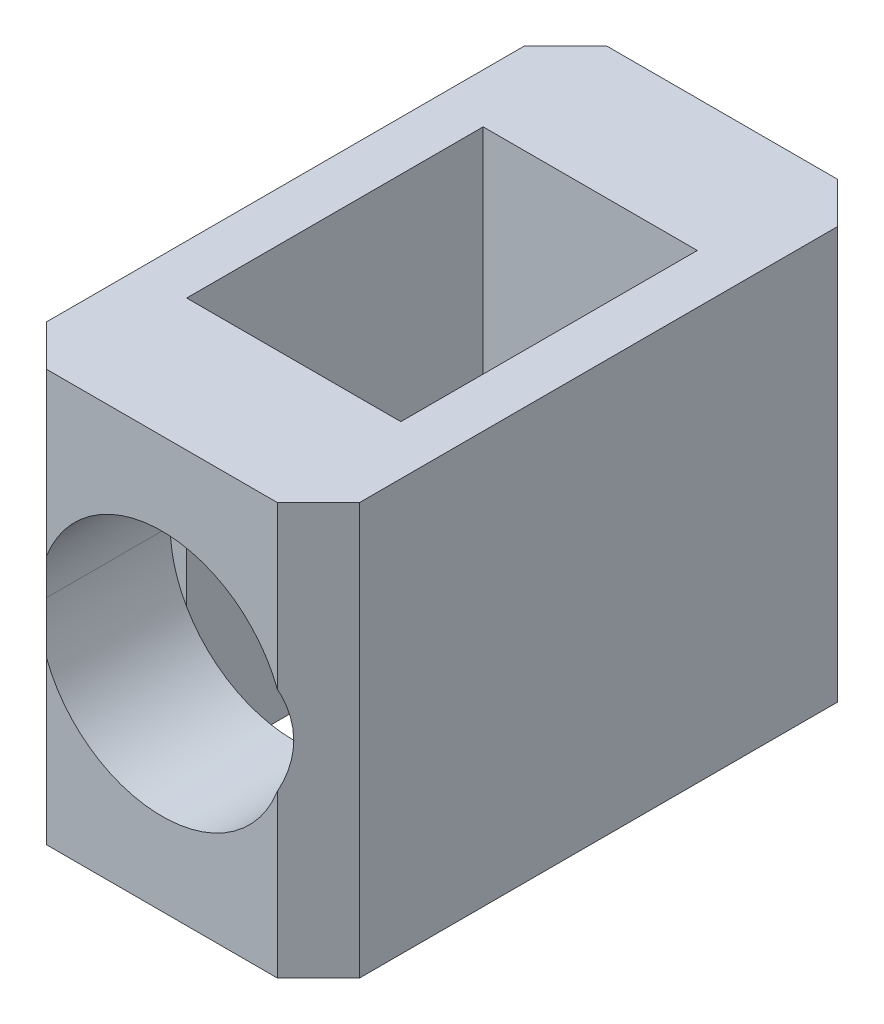
ISO-10303-21;
HEADER;
FILE_DESCRIPTION(('STEP AP214'),'2;1');
FILE_NAME('part.step','',(''),(''),'','','');
FILE_SCHEMA(('AUTOMOTIVE_DESIGN { 1 0 10303 214 1 1 1 1 }'));
ENDSEC;
DATA;
#1=APPLICATION_CONTEXT('core data for automotive mechanical design processes');
#2=APPLICATION_PROTOCOL_DEFINITION('international standard','automotive_design',2000,#1);
#3=PRODUCT_CONTEXT('',#1,'mechanical');
#4=PRODUCT('Part','Part','',(#3));
#5=PRODUCT_RELATED_PRODUCT_CATEGORY('part','',(#4));
#6=PRODUCT_DEFINITION_FORMATION('','',#4);
#7=PRODUCT_DEFINITION_CONTEXT('part definition',#1,'design');
#8=PRODUCT_DEFINITION('design','',#6,#7);
#9=PRODUCT_DEFINITION_SHAPE('','',#8);
#10=(LENGTH_UNIT() NAMED_UNIT(*) SI_UNIT(.MILLI.,.METRE.));
#11=(NAMED_UNIT(*) PLANE_ANGLE_UNIT() SI_UNIT($,.RADIAN.));
#12=(NAMED_UNIT(*) SI_UNIT($,.STERADIAN.) SOLID_ANGLE_UNIT());
#13=UNCERTAINTY_MEASURE_WITH_UNIT(LENGTH_MEASURE(1.E-05),#10,'distance_accuracy_value','');
#14=(GEOMETRIC_REPRESENTATION_CONTEXT(3) GLOBAL_UNCERTAINTY_ASSIGNED_CONTEXT((#13)) GLOBAL_UNIT_ASSIGNED_CONTEXT((#10,
#11,#12)) REPRESENTATION_CONTEXT('',''));
#15=CARTESIAN_POINT('',(0.,0.,0.));
#16=DIRECTION('',(0.,0.,1.));
#17=DIRECTION('',(1.,0.,0.));
#18=AXIS2_PLACEMENT_3D('',#15,#16,#17);
#19=CARTESIAN_POINT('',(12.6999999999998,5.27000000000021,8.43));
#20=DIRECTION('',(0.,0.,-1.));
#21=DIRECTION('',(-1.,0.,0.));
#22=AXIS2_PLACEMENT_3D('',#19,#20,#21);
#23=CYLINDRICAL_SURFACE('',#22,1.5);
#24=DIRECTION('',(0.,0.,1.));
#25=VECTOR('',#24,1.);
#26=CARTESIAN_POINT('',(11.2000000000003,5.26999999999963,8.43));
#27=LINE('',#26,#25);
#28=CARTESIAN_POINT('',(11.2000000000003,5.26999999999963,6.83));
#29=VERTEX_POINT('',#28);
#30=CARTESIAN_POINT('',(11.2000000000003,5.26999999999963,8.33));
#31=VERTEX_POINT('',#30);
#32=EDGE_CURVE('E235',#29,#31,#27,.T.);
#33=ORIENTED_EDGE('',*,*,#32,.F.);
#34=CARTESIAN_POINT('',(12.6999999999997,5.27000000000021,6.82999999999992));
#35=DIRECTION('',(0.,0.,1.));
#36=DIRECTION('',(-1.,0.,0.));
#37=AXIS2_PLACEMENT_3D('',#34,#35,#36);
#38=CIRCLE('',#37,1.5);
#39=CARTESIAN_POINT('',(11.4,6.01833147735468,6.83));
#40=VERTEX_POINT('',#39);
#41=EDGE_CURVE('E28',#40,#29,#38,.T.);
#42=ORIENTED_EDGE('',*,*,#41,.F.);
#43=CARTESIAN_POINT('',(12.6999999999997,5.27000000000021,6.83));
#44=DIRECTION('',(0.,0.,1.));
#45=DIRECTION('',(-1.,0.,0.));
#46=AXIS2_PLACEMENT_3D('',#43,#44,#45);
#47=CIRCLE('',#46,1.5);
#48=CARTESIAN_POINT('',(14.,6.01833147735475,6.82999999999989));
#49=VERTEX_POINT('',#48);
#50=EDGE_CURVE('E274',#49,#40,#47,.T.);
#51=ORIENTED_EDGE('',*,*,#50,.F.);
#52=CARTESIAN_POINT('',(12.6999999999997,5.27000000000021,6.82999999999992));
#53=DIRECTION('',(0.,0.,1.));
#54=DIRECTION('',(-1.,0.,0.));
#55=AXIS2_PLACEMENT_3D('',#52,#53,#54);
#56=CIRCLE('',#55,1.5);
#57=CARTESIAN_POINT('',(14.1999999999998,5.27000000000007,6.82999999999989));
#58=VERTEX_POINT('',#57);
#59=EDGE_CURVE('E11',#58,#49,#56,.T.);
#60=ORIENTED_EDGE('',*,*,#59,.F.);
#61=DIRECTION('',(0.,0.,1.));
#62=VECTOR('',#61,1.);
#63=CARTESIAN_POINT('',(14.2,5.27000000000007,8.43));
#64=LINE('',#63,#62);
#65=CARTESIAN_POINT('',(14.1999999999998,5.27000000000007,8.32999999999989));
#66=VERTEX_POINT('',#65);
#67=EDGE_CURVE('E232',#58,#66,#64,.T.);
#68=ORIENTED_EDGE('',*,*,#67,.T.);
#69=CARTESIAN_POINT('',(12.6999999999998,5.27000000000021,9.83));
#70=DIRECTION('',(0.707106781186561,0.,0.707106781186534));
#71=DIRECTION('',(-0.707106781186534,0.,0.707106781186561));
#72=AXIS2_PLACEMENT_3D('',#69,#70,#71);
#73=ELLIPSE('',#72,2.12132034355964,1.5);
#74=CARTESIAN_POINT('',(14.0999999999998,5.80851648071365,8.43));
#75=VERTEX_POINT('',#74);
#76=EDGE_CURVE('E246',#66,#75,#73,.T.);
#77=ORIENTED_EDGE('',*,*,#76,.T.);
#78=CARTESIAN_POINT('',(12.6999999999998,5.27000000000021,8.43));
#79=DIRECTION('',(0.,0.,1.));
#80=DIRECTION('',(-1.,0.,0.));
#81=AXIS2_PLACEMENT_3D('',#78,#79,#80);
#82=CIRCLE('',#81,1.5);
#83=CARTESIAN_POINT('',(11.3,5.80851648071329,8.43));
#84=VERTEX_POINT('',#83);
#85=EDGE_CURVE('E269',#75,#84,#82,.T.);
#86=ORIENTED_EDGE('',*,*,#85,.T.);
#87=CARTESIAN_POINT('',(12.6999999999998,5.27000000000021,9.83));
#88=DIRECTION('',(-0.707106781186535,0.,0.70710678118656));
#89=DIRECTION('',(0.70710678118656,0.,0.707106781186535));
#90=AXIS2_PLACEMENT_3D('',#87,#88,#89);
#91=ELLIPSE('',#90,2.12132034355964,1.5);
#92=EDGE_CURVE('E247',#84,#31,#91,.T.);
#93=ORIENTED_EDGE('',*,*,#92,.T.);
#94=EDGE_LOOP('',(#33,#42,#51,#60,#68,#77,#86,#93));
#95=FACE_BOUND('',#94,.T.);
#96=ADVANCED_FACE('F17',(#95),#23,.F.);
#97=CARTESIAN_POINT('',(14.0250000000003,5.26999999999963,6.82999999999989));
#98=DIRECTION('',(0.,0.,1.));
#99=DIRECTION('',(1.,0.,0.));
#100=AXIS2_PLACEMENT_3D('',#97,#98,#99);
#101=PLANE('',#100);
#102=DIRECTION('',(0.,-1.,0.));
#103=VECTOR('',#102,1.);
#104=CARTESIAN_POINT('',(13.9999999999998,2.77000000000016,6.82999999999989));
#105=LINE('',#104,#103);
#106=CARTESIAN_POINT('',(14.,4.52166852264494,6.82999999999989));
#107=VERTEX_POINT('',#106);
#108=EDGE_CURVE('E219',#49,#107,#105,.T.);
#109=ORIENTED_EDGE('',*,*,#108,.T.);
#110=CARTESIAN_POINT('',(12.6999999999997,5.27000000000021,6.82999999999992));
#111=DIRECTION('',(0.,0.,1.));
#112=DIRECTION('',(-1.,0.,0.));
#113=AXIS2_PLACEMENT_3D('',#110,#111,#112);
#114=CIRCLE('',#113,1.5);
#115=EDGE_CURVE('E117',#107,#58,#114,.T.);
#116=ORIENTED_EDGE('',*,*,#115,.T.);
#117=ORIENTED_EDGE('',*,*,#59,.T.);
#118=EDGE_LOOP('',(#109,#116,#117));
#119=FACE_BOUND('',#118,.T.);
#120=ADVANCED_FACE('F639',(#119),#101,.T.);
#121=CARTESIAN_POINT('',(14.0250000000003,5.26999999999963,6.82999999999989));
#122=DIRECTION('',(0.,0.,1.));
#123=DIRECTION('',(1.,0.,0.));
#124=AXIS2_PLACEMENT_3D('',#121,#122,#123);
#125=PLANE('',#124);
#126=CARTESIAN_POINT('',(12.6999999999997,5.27000000000021,6.82999999999992));
#127=DIRECTION('',(0.,0.,1.));
#128=DIRECTION('',(-1.,0.,0.));
#129=AXIS2_PLACEMENT_3D('',#126,#127,#128);
#130=CIRCLE('',#129,1.5);
#131=CARTESIAN_POINT('',(11.4000000000002,4.52166852264501,6.83));
#132=VERTEX_POINT('',#131);
#133=EDGE_CURVE('E254',#29,#132,#130,.T.);
#134=ORIENTED_EDGE('',*,*,#133,.T.);
#135=DIRECTION('',(0.,1.,0.));
#136=VECTOR('',#135,1.);
#137=CARTESIAN_POINT('',(11.4,2.77000000000016,6.83));
#138=LINE('',#137,#136);
#139=EDGE_CURVE('E334',#132,#40,#138,.T.);
#140=ORIENTED_EDGE('',*,*,#139,.T.);
#141=ORIENTED_EDGE('',*,*,#41,.T.);
#142=EDGE_LOOP('',(#134,#140,#141));
#143=FACE_BOUND('',#142,.T.);
#144=ADVANCED_FACE('F645',(#143),#125,.T.);
#145=CARTESIAN_POINT('',(12.6999999999998,5.27000000000021,8.43));
#146=DIRECTION('',(0.,0.,-1.));
#147=DIRECTION('',(-1.,0.,0.));
#148=AXIS2_PLACEMENT_3D('',#145,#146,#147);
#149=CYLINDRICAL_SURFACE('',#148,1.5);
#150=ORIENTED_EDGE('',*,*,#133,.F.);
#151=ORIENTED_EDGE('',*,*,#32,.T.);
#152=CARTESIAN_POINT('',(12.6999999999998,5.27000000000021,9.83));
#153=DIRECTION('',(-0.707106781186535,0.,0.70710678118656));
#154=DIRECTION('',(0.70710678118656,0.,0.707106781186535));
#155=AXIS2_PLACEMENT_3D('',#152,#153,#154);
#156=ELLIPSE('',#155,2.12132034355964,1.5);
#157=CARTESIAN_POINT('',(11.2999999999998,4.73148351928682,8.43));
#158=VERTEX_POINT('',#157);
#159=EDGE_CURVE('E245',#31,#158,#156,.T.);
#160=ORIENTED_EDGE('',*,*,#159,.T.);
#161=CARTESIAN_POINT('',(12.6999999999998,5.27000000000021,8.43));
#162=DIRECTION('',(0.,0.,1.));
#163=DIRECTION('',(-1.,0.,0.));
#164=AXIS2_PLACEMENT_3D('',#161,#162,#163);
#165=CIRCLE('',#164,1.5);
#166=CARTESIAN_POINT('',(14.1000000000002,4.73148351928624,8.43));
#167=VERTEX_POINT('',#166);
#168=EDGE_CURVE('E293',#158,#167,#165,.T.);
#169=ORIENTED_EDGE('',*,*,#168,.T.);
#170=CARTESIAN_POINT('',(12.6999999999998,5.27000000000021,9.83));
#171=DIRECTION('',(0.707106781186561,0.,0.707106781186534));
#172=DIRECTION('',(-0.707106781186534,0.,0.707106781186561));
#173=AXIS2_PLACEMENT_3D('',#170,#171,#172);
#174=ELLIPSE('',#173,2.12132034355964,1.5);
#175=EDGE_CURVE('E241',#167,#66,#174,.T.);
#176=ORIENTED_EDGE('',*,*,#175,.T.);
#177=ORIENTED_EDGE('',*,*,#67,.F.);
#178=ORIENTED_EDGE('',*,*,#115,.F.);
#179=CARTESIAN_POINT('',(12.6999999999997,5.27000000000021,6.83));
#180=DIRECTION('',(0.,0.,1.));
#181=DIRECTION('',(-1.,0.,0.));
#182=AXIS2_PLACEMENT_3D('',#179,#180,#181);
#183=CIRCLE('',#182,1.5);
#184=EDGE_CURVE('E251',#132,#107,#183,.T.);
#185=ORIENTED_EDGE('',*,*,#184,.F.);
#186=EDGE_LOOP('',(#150,#151,#160,#169,#176,#177,#178,#185));
#187=FACE_BOUND('',#186,.T.);
#188=ADVANCED_FACE('F439',(#187),#149,.F.);
#189=CARTESIAN_POINT('',(13.6999999999996,7.77000000000033,6.83));
#190=DIRECTION('',(0.,0.,1.));
#191=DIRECTION('',(1.,0.,0.));
#192=AXIS2_PLACEMENT_3D('',#189,#190,#191);
#193=PLANE('',#192);
#194=ORIENTED_EDGE('',*,*,#184,.T.);
#195=DIRECTION('',(0.,1.,0.));
#196=VECTOR('',#195,1.);
#197=CARTESIAN_POINT('',(13.9999999999998,2.77000000000016,6.83));
#198=LINE('',#197,#196);
#199=CARTESIAN_POINT('',(13.9999999999998,2.77000000000016,6.83));
#200=VERTEX_POINT('',#199);
#201=EDGE_CURVE('E227',#200,#107,#198,.T.);
#202=ORIENTED_EDGE('',*,*,#201,.F.);
#203=DIRECTION('',(1.,0.,0.));
#204=VECTOR('',#203,1.);
#205=CARTESIAN_POINT('',(70.6110968965142,2.7700000000002,6.82999999999898));
#206=LINE('',#205,#204);
#207=CARTESIAN_POINT('',(11.4,2.77000000000016,6.83));
#208=VERTEX_POINT('',#207);
#209=EDGE_CURVE('E132',#208,#200,#206,.T.);
#210=ORIENTED_EDGE('',*,*,#209,.F.);
#211=DIRECTION('',(0.,1.,0.));
#212=VECTOR('',#211,1.);
#213=CARTESIAN_POINT('',(11.4,2.77000000000016,6.83));
#214=LINE('',#213,#212);
#215=EDGE_CURVE('E338',#208,#132,#214,.T.);
#216=ORIENTED_EDGE('',*,*,#215,.T.);
#217=EDGE_LOOP('',(#194,#202,#210,#216));
#218=FACE_BOUND('',#217,.T.);
#219=ADVANCED_FACE('F711',(#218),#193,.F.);
#220=CARTESIAN_POINT('',(11.0500000000003,5.26999999999964,8.18));
#221=DIRECTION('',(-0.707106781186534,0.,0.707106781186561));
#222=DIRECTION('',(0.,1.,0.));
#223=AXIS2_PLACEMENT_3D('',#220,#221,#222);
#224=PLANE('',#223);
#225=DIRECTION('',(0.,1.,0.));
#226=VECTOR('',#225,1.);
#227=CARTESIAN_POINT('',(10.8,5.26999999999984,7.93));
#228=LINE('',#227,#226);
#229=CARTESIAN_POINT('',(10.7999999999998,2.77000000000016,7.93));
#230=VERTEX_POINT('',#229);
#231=CARTESIAN_POINT('',(10.8000000000003,7.76999999999961,7.93));
#232=VERTEX_POINT('',#231);
#233=EDGE_CURVE('E348',#230,#232,#228,.T.);
#234=ORIENTED_EDGE('',*,*,#233,.F.);
#235=DIRECTION('',(-0.70710678118656,0.,-0.707106781186535));
#236=VECTOR('',#235,1.);
#237=CARTESIAN_POINT('',(-51.920076808694,2.76999999999905,-54.7900768086914));
#238=LINE('',#237,#236);
#239=CARTESIAN_POINT('',(11.3000000000003,2.76999999999965,8.43));
#240=VERTEX_POINT('',#239);
#241=EDGE_CURVE('E240',#240,#230,#238,.T.);
#242=ORIENTED_EDGE('',*,*,#241,.F.);
#243=DIRECTION('',(0.,1.,0.));
#244=VECTOR('',#243,1.);
#245=CARTESIAN_POINT('',(11.2999999999998,5.27000000000006,8.43));
#246=LINE('',#245,#244);
#247=EDGE_CURVE('E297',#240,#158,#246,.T.);
#248=ORIENTED_EDGE('',*,*,#247,.T.);
#249=ORIENTED_EDGE('',*,*,#159,.F.);
#250=ORIENTED_EDGE('',*,*,#92,.F.);
#251=DIRECTION('',(0.,1.,0.));
#252=VECTOR('',#251,1.);
#253=CARTESIAN_POINT('',(11.2999999999998,5.27000000000006,8.43));
#254=LINE('',#253,#252);
#255=CARTESIAN_POINT('',(11.3,7.76999999999983,8.43));
#256=VERTEX_POINT('',#255);
#257=EDGE_CURVE('E284',#84,#256,#254,.T.);
#258=ORIENTED_EDGE('',*,*,#257,.T.);
#259=DIRECTION('',(-0.70710678118656,0.,-0.707106781186535));
#260=VECTOR('',#259,1.);
#261=CARTESIAN_POINT('',(-51.9200768086941,7.76999999999941,-54.7900768086914));
#262=LINE('',#261,#260);
#263=EDGE_CURVE('E353',#256,#232,#262,.T.);
#264=ORIENTED_EDGE('',*,*,#263,.T.);
#265=EDGE_LOOP('',(#234,#242,#248,#249,#250,#258,#264));
#266=FACE_BOUND('',#265,.T.);
#267=ADVANCED_FACE('F440',(#266),#224,.T.);
#268=CARTESIAN_POINT('',(14.35,5.27,8.18));
#269=DIRECTION('',(0.70710678118656,0.,0.707106781186535));
#270=DIRECTION('',(0.,-1.,0.));
#271=AXIS2_PLACEMENT_3D('',#268,#269,#270);
#272=PLANE('',#271);
#273=DIRECTION('',(0.,-1.,0.));
#274=VECTOR('',#273,1.);
#275=CARTESIAN_POINT('',(14.6000000000002,5.26999999999985,7.93));
#276=LINE('',#275,#274);
#277=CARTESIAN_POINT('',(14.5999999999997,7.77000000000023,7.93));
#278=VERTEX_POINT('',#277);
#279=CARTESIAN_POINT('',(14.6,2.77000000000009,7.93));
#280=VERTEX_POINT('',#279);
#281=EDGE_CURVE('E379',#278,#280,#276,.T.);
#282=ORIENTED_EDGE('',*,*,#281,.F.);
#283=DIRECTION('',(-0.707106781186534,0.,0.707106781186561));
#284=VECTOR('',#283,1.);
#285=CARTESIAN_POINT('',(77.3200768086914,7.77000000000049,-54.7900768086937));
#286=LINE('',#285,#284);
#287=CARTESIAN_POINT('',(14.1,7.77,8.43));
#288=VERTEX_POINT('',#287);
#289=EDGE_CURVE('E231',#278,#288,#286,.T.);
#290=ORIENTED_EDGE('',*,*,#289,.T.);
#291=DIRECTION('',(0.,-1.,0.));
#292=VECTOR('',#291,1.);
#293=CARTESIAN_POINT('',(14.1000000000004,5.26999999999964,8.43));
#294=LINE('',#293,#292);
#295=EDGE_CURVE('E273',#288,#75,#294,.T.);
#296=ORIENTED_EDGE('',*,*,#295,.T.);
#297=ORIENTED_EDGE('',*,*,#76,.F.);
#298=ORIENTED_EDGE('',*,*,#175,.F.);
#299=DIRECTION('',(0.,-1.,0.));
#300=VECTOR('',#299,1.);
#301=CARTESIAN_POINT('',(14.1000000000004,5.26999999999964,8.43));
#302=LINE('',#301,#300);
#303=CARTESIAN_POINT('',(14.1,2.76999999999987,8.43));
#304=VERTEX_POINT('',#303);
#305=EDGE_CURVE('E214',#167,#304,#302,.T.);
#306=ORIENTED_EDGE('',*,*,#305,.T.);
#307=DIRECTION('',(-0.707106781186534,0.,0.707106781186561));
#308=VECTOR('',#307,1.);
#309=CARTESIAN_POINT('',(77.3200768086915,2.77000000000048,-54.7900768086937));
#310=LINE('',#309,#308);
#311=EDGE_CURVE('E281',#280,#304,#310,.T.);
#312=ORIENTED_EDGE('',*,*,#311,.F.);
#313=EDGE_LOOP('',(#282,#290,#296,#297,#298,#306,#312));
#314=FACE_BOUND('',#313,.T.);
#315=ADVANCED_FACE('F444',(#314),#272,.T.);
#316=CARTESIAN_POINT('',(11.0500000000002,5.26999999999964,1.87999999999996));
#317=DIRECTION('',(-0.70710678118656,0.,-0.707106781186535));
#318=DIRECTION('',(-0.707106781186535,0.,0.70710678118656));
#319=AXIS2_PLACEMENT_3D('',#316,#317,#318);
#320=PLANE('',#319);
#321=DIRECTION('',(0.,-1.,0.));
#322=VECTOR('',#321,1.);
#323=CARTESIAN_POINT('',(10.8,5.26999999999984,2.12999999999996));
#324=LINE('',#323,#322);
#325=CARTESIAN_POINT('',(10.8000000000002,7.76999999999961,2.13000000000006));
#326=VERTEX_POINT('',#325);
#327=CARTESIAN_POINT('',(10.7999999999997,2.77000000000016,2.13000000000006));
#328=VERTEX_POINT('',#327);
#329=EDGE_CURVE('E260',#326,#328,#324,.T.);
#330=ORIENTED_EDGE('',*,*,#329,.F.);
#331=DIRECTION('',(0.707106781186534,0.,-0.707106781186561));
#332=VECTOR('',#331,1.);
#333=CARTESIAN_POINT('',(67.7200768086915,7.77000000000034,-54.7900768086936));
#334=LINE('',#333,#332);
#335=CARTESIAN_POINT('',(11.3,7.76999999999983,1.63000000000004));
#336=VERTEX_POINT('',#335);
#337=EDGE_CURVE('E357',#326,#336,#334,.T.);
#338=ORIENTED_EDGE('',*,*,#337,.T.);
#339=DIRECTION('',(0.,-1.,0.));
#340=VECTOR('',#339,1.);
#341=CARTESIAN_POINT('',(11.2999999999997,5.27000000000006,1.62999999999994));
#342=LINE('',#341,#340);
#343=CARTESIAN_POINT('',(11.3000000000002,2.76999999999965,1.63000000000004));
#344=VERTEX_POINT('',#343);
#345=EDGE_CURVE('E290',#336,#344,#342,.T.);
#346=ORIENTED_EDGE('',*,*,#345,.T.);
#347=DIRECTION('',(0.707106781186534,0.,-0.707106781186561));
#348=VECTOR('',#347,1.);
#349=CARTESIAN_POINT('',(67.7200768086917,2.77000000000019,-54.7900768086936));
#350=LINE('',#349,#348);
#351=EDGE_CURVE('E236',#328,#344,#350,.T.);
#352=ORIENTED_EDGE('',*,*,#351,.F.);
#353=EDGE_LOOP('',(#330,#338,#346,#352));
#354=FACE_BOUND('',#353,.T.);
#355=ADVANCED_FACE('F394',(#354),#320,.T.);
#356=CARTESIAN_POINT('',(14.3499999999998,5.27,1.87999999999989));
#357=DIRECTION('',(0.707106781186535,0.,-0.707106781186561));
#358=DIRECTION('',(0.,-1.,0.));
#359=AXIS2_PLACEMENT_3D('',#356,#357,#358);
#360=PLANE('',#359);
#361=DIRECTION('',(0.,-1.,0.));
#362=VECTOR('',#361,1.);
#363=CARTESIAN_POINT('',(14.1000000000002,5.26999999999964,1.6299999999999));
#364=LINE('',#363,#362);
#365=CARTESIAN_POINT('',(14.0999999999997,7.77,1.63));
#366=VERTEX_POINT('',#365);
#367=CARTESIAN_POINT('',(14.1,2.76999999999987,1.63));
#368=VERTEX_POINT('',#367);
#369=EDGE_CURVE('E201',#366,#368,#364,.T.);
#370=ORIENTED_EDGE('',*,*,#369,.F.);
#371=DIRECTION('',(0.70710678118656,0.,0.707106781186535));
#372=VECTOR('',#371,1.);
#373=CARTESIAN_POINT('',(-42.3200768086939,7.76999999999941,-54.7900768086916));
#374=LINE('',#373,#372);
#375=CARTESIAN_POINT('',(14.5999999999996,7.77000000000023,2.13));
#376=VERTEX_POINT('',#375);
#377=EDGE_CURVE('E202',#366,#376,#374,.T.);
#378=ORIENTED_EDGE('',*,*,#377,.T.);
#379=DIRECTION('',(0.,-1.,0.));
#380=VECTOR('',#379,1.);
#381=CARTESIAN_POINT('',(14.6,5.26999999999985,2.12999999999989));
#382=LINE('',#381,#380);
#383=CARTESIAN_POINT('',(14.5999999999998,2.77000000000009,2.13));
#384=VERTEX_POINT('',#383);
#385=EDGE_CURVE('E275',#376,#384,#382,.T.);
#386=ORIENTED_EDGE('',*,*,#385,.T.);
#387=DIRECTION('',(0.70710678118656,0.,0.707106781186535));
#388=VECTOR('',#387,1.);
#389=CARTESIAN_POINT('',(-42.3200768086939,2.76999999999905,-54.7900768086916));
#390=LINE('',#389,#388);
#391=EDGE_CURVE('E239',#368,#384,#390,.T.);
#392=ORIENTED_EDGE('',*,*,#391,.F.);
#393=EDGE_LOOP('',(#370,#378,#386,#392));
#394=FACE_BOUND('',#393,.T.);
#395=ADVANCED_FACE('F689',(#394),#360,.T.);
#396=CARTESIAN_POINT('',(70.611096896513,2.77000000000019,-54.7900768086936));
#397=DIRECTION('',(0.,1.,0.));
#398=DIRECTION('',(1.,0.,0.));
#399=AXIS2_PLACEMENT_3D('',#396,#397,#398);
#400=PLANE('',#399);
#401=DIRECTION('',(0.,0.,1.));
#402=VECTOR('',#401,1.);
#403=CARTESIAN_POINT('',(11.3999999999988,2.77000000000015,-54.7900768086926));
#404=LINE('',#403,#402);
#405=CARTESIAN_POINT('',(11.3999999999998,2.77000000000016,3.22999999999994));
#406=VERTEX_POINT('',#405);
#407=EDGE_CURVE('E311',#406,#208,#404,.T.);
#408=ORIENTED_EDGE('',*,*,#407,.T.);
#409=ORIENTED_EDGE('',*,*,#209,.T.);
#410=DIRECTION('',(0.,0.,-1.));
#411=VECTOR('',#410,1.);
#412=CARTESIAN_POINT('',(13.9999999999987,2.77000000000015,-54.7900768086926));
#413=LINE('',#412,#411);
#414=CARTESIAN_POINT('',(13.9999999999998,2.77000000000016,3.22999999999989));
#415=VERTEX_POINT('',#414);
#416=EDGE_CURVE('E309',#200,#415,#413,.T.);
#417=ORIENTED_EDGE('',*,*,#416,.T.);
#418=DIRECTION('',(-1.,0.,0.));
#419=VECTOR('',#418,1.);
#420=CARTESIAN_POINT('',(70.6110968965141,2.7700000000002,3.22999999999887));
#421=LINE('',#420,#419);
#422=EDGE_CURVE('E339',#415,#406,#421,.T.);
#423=ORIENTED_EDGE('',*,*,#422,.T.);
#424=EDGE_LOOP('',(#408,#409,#417,#423));
#425=FACE_BOUND('',#424,.T.);
#426=DIRECTION('',(0.,0.,-1.));
#427=VECTOR('',#426,1.);
#428=CARTESIAN_POINT('',(14.5999999999988,2.77000000000008,-54.7900768086926));
#429=LINE('',#428,#427);
#430=EDGE_CURVE('E280',#280,#384,#429,.T.);
#431=ORIENTED_EDGE('',*,*,#430,.F.);
#432=ORIENTED_EDGE('',*,*,#311,.T.);
#433=DIRECTION('',(-1.,0.,0.));
#434=VECTOR('',#433,1.);
#435=CARTESIAN_POINT('',(70.6110968965142,2.7700000000002,8.42999999999897));
#436=LINE('',#435,#434);
#437=EDGE_CURVE('E21',#304,#240,#436,.T.);
#438=ORIENTED_EDGE('',*,*,#437,.T.);
#439=ORIENTED_EDGE('',*,*,#241,.T.);
#440=DIRECTION('',(0.,0.,-1.));
#441=VECTOR('',#440,1.);
#442=CARTESIAN_POINT('',(10.7999999999987,2.77000000000016,-54.7900768086925));
#443=LINE('',#442,#441);
#444=EDGE_CURVE('E255',#230,#328,#443,.T.);
#445=ORIENTED_EDGE('',*,*,#444,.T.);
#446=ORIENTED_EDGE('',*,*,#351,.T.);
#447=DIRECTION('',(-1.,0.,0.));
#448=VECTOR('',#447,1.);
#449=CARTESIAN_POINT('',(70.6110968965141,2.7700000000002,1.62999999999888));
#450=LINE('',#449,#448);
#451=EDGE_CURVE('E298',#368,#344,#450,.T.);
#452=ORIENTED_EDGE('',*,*,#451,.F.);
#453=ORIENTED_EDGE('',*,*,#391,.T.);
#454=EDGE_LOOP('',(#431,#432,#438,#439,#445,#446,#452,#453));
#455=FACE_BOUND('',#454,.T.);
#456=ADVANCED_FACE('F402',(#425,#455),#400,.F.);
#457=CARTESIAN_POINT('',(13.9000000000003,2.76999999999965,8.43));
#458=DIRECTION('',(0.,0.,1.));
#459=DIRECTION('',(1.,0.,0.));
#460=AXIS2_PLACEMENT_3D('',#457,#458,#459);
#461=PLANE('',#460);
#462=ORIENTED_EDGE('',*,*,#85,.F.);
#463=ORIENTED_EDGE('',*,*,#295,.F.);
#464=DIRECTION('',(-1.,0.,0.));
#465=VECTOR('',#464,1.);
#466=CARTESIAN_POINT('',(70.611096896514,7.77000000000035,8.42999999999897));
#467=LINE('',#466,#465);
#468=EDGE_CURVE('E356',#288,#256,#467,.T.);
#469=ORIENTED_EDGE('',*,*,#468,.T.);
#470=ORIENTED_EDGE('',*,*,#257,.F.);
#471=EDGE_LOOP('',(#462,#463,#469,#470));
#472=FACE_BOUND('',#471,.T.);
#473=ADVANCED_FACE('F442',(#472),#461,.T.);
#474=CARTESIAN_POINT('',(13.6999999999996,7.77000000000033,6.83));
#475=DIRECTION('',(0.,0.,1.));
#476=DIRECTION('',(1.,0.,0.));
#477=AXIS2_PLACEMENT_3D('',#474,#475,#476);
#478=PLANE('',#477);
#479=DIRECTION('',(0.,1.,0.));
#480=VECTOR('',#479,1.);
#481=CARTESIAN_POINT('',(13.9999999999998,2.77000000000016,6.83));
#482=LINE('',#481,#480);
#483=CARTESIAN_POINT('',(13.9999999999996,7.77000000000031,6.83));
#484=VERTEX_POINT('',#483);
#485=EDGE_CURVE('E195',#49,#484,#482,.T.);
#486=ORIENTED_EDGE('',*,*,#485,.F.);
#487=ORIENTED_EDGE('',*,*,#50,.T.);
#488=DIRECTION('',(0.,1.,0.));
#489=VECTOR('',#488,1.);
#490=CARTESIAN_POINT('',(11.4,2.77000000000016,6.83));
#491=LINE('',#490,#489);
#492=CARTESIAN_POINT('',(11.3999999999997,7.77000000000031,6.83));
#493=VERTEX_POINT('',#492);
#494=EDGE_CURVE('E198',#40,#493,#491,.T.);
#495=ORIENTED_EDGE('',*,*,#494,.T.);
#496=DIRECTION('',(1.,0.,0.));
#497=VECTOR('',#496,1.);
#498=CARTESIAN_POINT('',(70.6110968965139,7.77000000000035,6.82999999999898));
#499=LINE('',#498,#497);
#500=EDGE_CURVE('E161',#493,#484,#499,.T.);
#501=ORIENTED_EDGE('',*,*,#500,.T.);
#502=EDGE_LOOP('',(#486,#487,#495,#501));
#503=FACE_BOUND('',#502,.T.);
#504=ADVANCED_FACE('F193',(#503),#478,.F.);
#505=CARTESIAN_POINT('',(11.5,2.76999999999987,1.62999999999994));
#506=DIRECTION('',(0.,0.,-1.));
#507=DIRECTION('',(-1.,0.,0.));
#508=AXIS2_PLACEMENT_3D('',#505,#506,#507);
#509=PLANE('',#508);
#510=ORIENTED_EDGE('',*,*,#369,.T.);
#511=ORIENTED_EDGE('',*,*,#451,.T.);
#512=ORIENTED_EDGE('',*,*,#345,.F.);
#513=DIRECTION('',(-1.,0.,0.));
#514=VECTOR('',#513,1.);
#515=CARTESIAN_POINT('',(70.6110968965138,7.77000000000035,1.62999999999888));
#516=LINE('',#515,#514);
#517=EDGE_CURVE('E383',#366,#336,#516,.T.);
#518=ORIENTED_EDGE('',*,*,#517,.F.);
#519=EDGE_LOOP('',(#510,#511,#512,#518));
#520=FACE_BOUND('',#519,.T.);
#521=ADVANCED_FACE('F399',(#520),#509,.T.);
#522=CARTESIAN_POINT('',(11.6916410670894,7.76999999999981,7.62205114905214));
#523=DIRECTION('',(0.,1.,0.));
#524=DIRECTION('',(1.,0.,0.));
#525=AXIS2_PLACEMENT_3D('',#522,#523,#524);
#526=PLANE('',#525);
#527=DIRECTION('',(-1.,0.,0.));
#528=VECTOR('',#527,1.);
#529=CARTESIAN_POINT('',(70.6110968965139,7.77000000000035,3.22999999999887));
#530=LINE('',#529,#528);
#531=CARTESIAN_POINT('',(13.9999999999995,7.77000000000031,3.22999999999989));
#532=VERTEX_POINT('',#531);
#533=CARTESIAN_POINT('',(11.3999999999996,7.77000000000031,3.22999999999994));
#534=VERTEX_POINT('',#533);
#535=EDGE_CURVE('E209',#532,#534,#530,.T.);
#536=ORIENTED_EDGE('',*,*,#535,.F.);
#537=DIRECTION('',(0.,0.,-1.));
#538=VECTOR('',#537,1.);
#539=CARTESIAN_POINT('',(13.9999999999985,7.7700000000003,-54.7900768086926));
#540=LINE('',#539,#538);
#541=EDGE_CURVE('E205',#484,#532,#540,.T.);
#542=ORIENTED_EDGE('',*,*,#541,.F.);
#543=ORIENTED_EDGE('',*,*,#500,.F.);
#544=DIRECTION('',(0.,0.,1.));
#545=VECTOR('',#544,1.);
#546=CARTESIAN_POINT('',(11.3999999999985,7.7700000000003,-54.7900768086926));
#547=LINE('',#546,#545);
#548=EDGE_CURVE('E259',#534,#493,#547,.T.);
#549=ORIENTED_EDGE('',*,*,#548,.F.);
#550=EDGE_LOOP('',(#536,#542,#543,#549));
#551=FACE_BOUND('',#550,.T.);
#552=ORIENTED_EDGE('',*,*,#517,.T.);
#553=ORIENTED_EDGE('',*,*,#337,.F.);
#554=DIRECTION('',(0.,0.,-1.));
#555=VECTOR('',#554,1.);
#556=CARTESIAN_POINT('',(10.7999999999992,7.7699999999996,-54.7900768086925));
#557=LINE('',#556,#555);
#558=EDGE_CURVE('E266',#232,#326,#557,.T.);
#559=ORIENTED_EDGE('',*,*,#558,.F.);
#560=ORIENTED_EDGE('',*,*,#263,.F.);
#561=ORIENTED_EDGE('',*,*,#468,.F.);
#562=ORIENTED_EDGE('',*,*,#289,.F.);
#563=DIRECTION('',(0.,0.,-1.));
#564=VECTOR('',#563,1.);
#565=CARTESIAN_POINT('',(14.5999999999986,7.77000000000022,-54.7900768086926));
#566=LINE('',#565,#564);
#567=EDGE_CURVE('E279',#278,#376,#566,.T.);
#568=ORIENTED_EDGE('',*,*,#567,.T.);
#569=ORIENTED_EDGE('',*,*,#377,.F.);
#570=EDGE_LOOP('',(#552,#553,#559,#560,#561,#562,#568,#569));
#571=FACE_BOUND('',#570,.T.);
#572=ADVANCED_FACE('F206',(#551,#571),#526,.T.);
#573=CARTESIAN_POINT('',(14.5999999999998,2.77000000000009,2.33));
#574=DIRECTION('',(1.,0.,0.));
#575=DIRECTION('',(0.,0.,-1.));
#576=AXIS2_PLACEMENT_3D('',#573,#574,#575);
#577=PLANE('',#576);
#578=ORIENTED_EDGE('',*,*,#281,.T.);
#579=ORIENTED_EDGE('',*,*,#430,.T.);
#580=ORIENTED_EDGE('',*,*,#385,.F.);
#581=ORIENTED_EDGE('',*,*,#567,.F.);
#582=EDGE_LOOP('',(#578,#579,#580,#581));
#583=FACE_BOUND('',#582,.T.);
#584=ADVANCED_FACE('F19',(#583),#577,.T.);
#585=CARTESIAN_POINT('',(13.9000000000003,2.76999999999965,8.43));
#586=DIRECTION('',(0.,0.,1.));
#587=DIRECTION('',(1.,0.,0.));
#588=AXIS2_PLACEMENT_3D('',#585,#586,#587);
#589=PLANE('',#588);
#590=ORIENTED_EDGE('',*,*,#305,.F.);
#591=ORIENTED_EDGE('',*,*,#168,.F.);
#592=ORIENTED_EDGE('',*,*,#247,.F.);
#593=ORIENTED_EDGE('',*,*,#437,.F.);
#594=EDGE_LOOP('',(#590,#591,#592,#593));
#595=FACE_BOUND('',#594,.T.);
#596=ADVANCED_FACE('F437',(#595),#589,.T.);
#597=CARTESIAN_POINT('',(13.9999999999995,7.77000000000031,3.53));
#598=DIRECTION('',(1.,0.,0.));
#599=DIRECTION('',(0.,0.,-1.));
#600=AXIS2_PLACEMENT_3D('',#597,#598,#599);
#601=PLANE('',#600);
#602=DIRECTION('',(0.,1.,0.));
#603=VECTOR('',#602,1.);
#604=CARTESIAN_POINT('',(13.9999999999998,2.77000000000016,3.22999999999989));
#605=LINE('',#604,#603);
#606=EDGE_CURVE('E343',#415,#532,#605,.T.);
#607=ORIENTED_EDGE('',*,*,#606,.F.);
#608=ORIENTED_EDGE('',*,*,#416,.F.);
#609=ORIENTED_EDGE('',*,*,#201,.T.);
#610=ORIENTED_EDGE('',*,*,#108,.F.);
#611=ORIENTED_EDGE('',*,*,#485,.T.);
#612=ORIENTED_EDGE('',*,*,#541,.T.);
#613=EDGE_LOOP('',(#607,#608,#609,#610,#611,#612));
#614=FACE_BOUND('',#613,.T.);
#615=ADVANCED_FACE('F216',(#614),#601,.F.);
#616=CARTESIAN_POINT('',(11.3999999999996,7.77000000000031,3.53));
#617=DIRECTION('',(-1.,0.,0.));
#618=DIRECTION('',(0.,1.,0.));
#619=AXIS2_PLACEMENT_3D('',#616,#617,#618);
#620=PLANE('',#619);
#621=ORIENTED_EDGE('',*,*,#548,.T.);
#622=ORIENTED_EDGE('',*,*,#494,.F.);
#623=ORIENTED_EDGE('',*,*,#139,.F.);
#624=ORIENTED_EDGE('',*,*,#215,.F.);
#625=ORIENTED_EDGE('',*,*,#407,.F.);
#626=DIRECTION('',(0.,1.,0.));
#627=VECTOR('',#626,1.);
#628=CARTESIAN_POINT('',(11.3999999999998,2.77000000000016,3.22999999999994));
#629=LINE('',#628,#627);
#630=EDGE_CURVE('E344',#406,#534,#629,.T.);
#631=ORIENTED_EDGE('',*,*,#630,.T.);
#632=EDGE_LOOP('',(#621,#622,#623,#624,#625,#631));
#633=FACE_BOUND('',#632,.T.);
#634=ADVANCED_FACE('F656',(#633),#620,.F.);
#635=CARTESIAN_POINT('',(10.7999999999998,2.77000000000016,7.73));
#636=DIRECTION('',(-1.,0.,0.));
#637=DIRECTION('',(0.,1.,0.));
#638=AXIS2_PLACEMENT_3D('',#635,#636,#637);
#639=PLANE('',#638);
#640=ORIENTED_EDGE('',*,*,#233,.T.);
#641=ORIENTED_EDGE('',*,*,#558,.T.);
#642=ORIENTED_EDGE('',*,*,#329,.T.);
#643=ORIENTED_EDGE('',*,*,#444,.F.);
#644=EDGE_LOOP('',(#640,#641,#642,#643));
#645=FACE_BOUND('',#644,.T.);
#646=ADVANCED_FACE('F407',(#645),#639,.T.);
#647=CARTESIAN_POINT('',(11.6999999999996,7.77000000000026,3.22999999999994));
#648=DIRECTION('',(0.,0.,-1.));
#649=DIRECTION('',(-1.,0.,0.));
#650=AXIS2_PLACEMENT_3D('',#647,#648,#649);
#651=PLANE('',#650);
#652=ORIENTED_EDGE('',*,*,#630,.F.);
#653=ORIENTED_EDGE('',*,*,#422,.F.);
#654=ORIENTED_EDGE('',*,*,#606,.T.);
#655=ORIENTED_EDGE('',*,*,#535,.T.);
#656=EDGE_LOOP('',(#652,#653,#654,#655));
#657=FACE_BOUND('',#656,.T.);
#658=ADVANCED_FACE('F752',(#657),#651,.F.);
#659=CLOSED_SHELL('',(#96,#120,#144,#188,#219,#267,#315,#355,#395,#456,#473,#504,#521,#572,#584,
#596,#615,#634,#646,#658));
#660=MANIFOLD_SOLID_BREP('B1',#659);
#661=ADVANCED_BREP_SHAPE_REPRESENTATION('',(#18,#660),#14);
#662=SHAPE_DEFINITION_REPRESENTATION(#9,#661);
ENDSEC;
END-ISO-10303-21;
